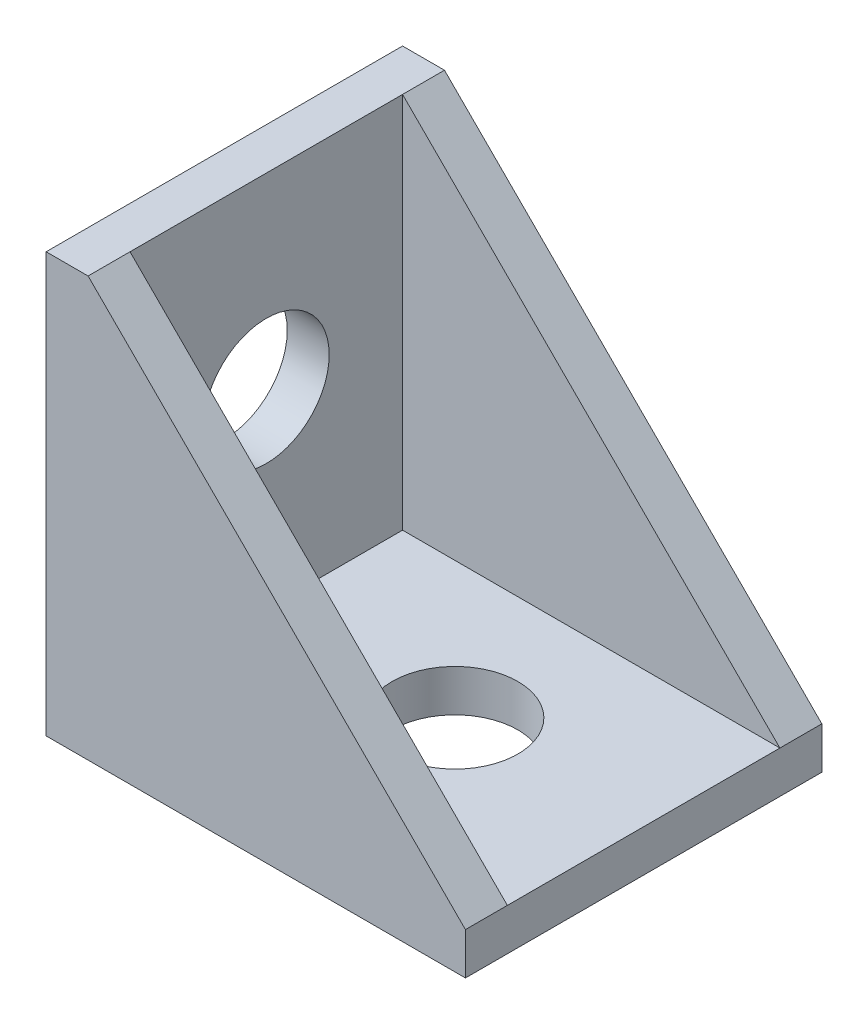
ISO-10303-21;
HEADER;
FILE_DESCRIPTION(('STEP AP214'),'2;1');
FILE_NAME('part.step','',(''),(''),'','','');
FILE_SCHEMA(('AUTOMOTIVE_DESIGN { 1 0 10303 214 1 1 1 1 }'));
ENDSEC;
DATA;
#1=APPLICATION_CONTEXT('core data for automotive mechanical design processes');
#2=APPLICATION_PROTOCOL_DEFINITION('international standard','automotive_design',2000,#1);
#3=PRODUCT_CONTEXT('',#1,'mechanical');
#4=PRODUCT('Part','Part','',(#3));
#5=PRODUCT_RELATED_PRODUCT_CATEGORY('part','',(#4));
#6=PRODUCT_DEFINITION_FORMATION('','',#4);
#7=PRODUCT_DEFINITION_CONTEXT('part definition',#1,'design');
#8=PRODUCT_DEFINITION('design','',#6,#7);
#9=PRODUCT_DEFINITION_SHAPE('','',#8);
#10=(LENGTH_UNIT() NAMED_UNIT(*) SI_UNIT(.MILLI.,.METRE.));
#11=(NAMED_UNIT(*) PLANE_ANGLE_UNIT() SI_UNIT($,.RADIAN.));
#12=(NAMED_UNIT(*) SI_UNIT($,.STERADIAN.) SOLID_ANGLE_UNIT());
#13=UNCERTAINTY_MEASURE_WITH_UNIT(LENGTH_MEASURE(1.E-05),#10,'distance_accuracy_value','');
#14=(GEOMETRIC_REPRESENTATION_CONTEXT(3) GLOBAL_UNCERTAINTY_ASSIGNED_CONTEXT((#13)) GLOBAL_UNIT_ASSIGNED_CONTEXT((#10,
#11,#12)) REPRESENTATION_CONTEXT('',''));
#15=CARTESIAN_POINT('',(0.,0.,0.));
#16=DIRECTION('',(0.,0.,1.));
#17=DIRECTION('',(1.,0.,0.));
#18=AXIS2_PLACEMENT_3D('',#15,#16,#17);
#19=CARTESIAN_POINT('',(2.,20.,17.));
#20=DIRECTION('',(-0.707106781186548,-0.707106781186548,0.));
#21=DIRECTION('',(0.707106781186548,-0.707106781186548,0.));
#22=AXIS2_PLACEMENT_3D('',#19,#20,#21);
#23=PLANE('',#22);
#24=DIRECTION('',(0.,0.,-1.));
#25=VECTOR('',#24,1.);
#26=CARTESIAN_POINT('',(2.,20.,17.));
#27=LINE('',#26,#25);
#28=CARTESIAN_POINT('',(2.,20.,2.));
#29=VERTEX_POINT('',#28);
#30=CARTESIAN_POINT('',(2.,20.,0.));
#31=VERTEX_POINT('',#30);
#32=EDGE_CURVE('E116',#29,#31,#27,.T.);
#33=ORIENTED_EDGE('',*,*,#32,.F.);
#34=DIRECTION('',(0.707106781186548,-0.707106781186548,0.));
#35=VECTOR('',#34,1.);
#36=CARTESIAN_POINT('',(2.,20.,2.));
#37=LINE('',#36,#35);
#38=CARTESIAN_POINT('',(20.,2.,2.));
#39=VERTEX_POINT('',#38);
#40=EDGE_CURVE('E12',#29,#39,#37,.T.);
#41=ORIENTED_EDGE('',*,*,#40,.T.);
#42=DIRECTION('',(0.,0.,-1.));
#43=VECTOR('',#42,1.);
#44=CARTESIAN_POINT('',(20.,2.,17.));
#45=LINE('',#44,#43);
#46=CARTESIAN_POINT('',(20.,2.,0.));
#47=VERTEX_POINT('',#46);
#48=EDGE_CURVE('E115',#39,#47,#45,.T.);
#49=ORIENTED_EDGE('',*,*,#48,.T.);
#50=DIRECTION('',(-0.707106781186547,0.707106781186547,0.));
#51=VECTOR('',#50,1.);
#52=CARTESIAN_POINT('',(2.,20.,0.));
#53=LINE('',#52,#51);
#54=EDGE_CURVE('E132',#47,#31,#53,.T.);
#55=ORIENTED_EDGE('',*,*,#54,.T.);
#56=EDGE_LOOP('',(#33,#41,#49,#55));
#57=FACE_BOUND('',#56,.T.);
#58=ADVANCED_FACE('F34',(#57),#23,.F.);
#59=CARTESIAN_POINT('',(20.,0.,17.));
#60=DIRECTION('',(0.,1.,0.));
#61=DIRECTION('',(-1.,0.,0.));
#62=AXIS2_PLACEMENT_3D('',#59,#60,#61);
#63=PLANE('',#62);
#64=CARTESIAN_POINT('',(11.,0.,8.5));
#65=DIRECTION('',(0.,1.,0.));
#66=DIRECTION('',(-1.,0.,0.));
#67=AXIS2_PLACEMENT_3D('',#64,#65,#66);
#68=CIRCLE('',#67,3.);
#69=CARTESIAN_POINT('',(8.,0.,8.5));
#70=VERTEX_POINT('',#69);
#71=EDGE_CURVE('E193',#70,#70,#68,.T.);
#72=ORIENTED_EDGE('',*,*,#71,.T.);
#73=EDGE_LOOP('',(#72));
#74=FACE_BOUND('',#73,.T.);
#75=DIRECTION('',(1.,0.,0.));
#76=VECTOR('',#75,1.);
#77=CARTESIAN_POINT('',(20.,0.,0.));
#78=LINE('',#77,#76);
#79=CARTESIAN_POINT('',(0.,0.,0.));
#80=VERTEX_POINT('',#79);
#81=CARTESIAN_POINT('',(20.,0.,0.));
#82=VERTEX_POINT('',#81);
#83=EDGE_CURVE('E125',#80,#82,#78,.T.);
#84=ORIENTED_EDGE('',*,*,#83,.T.);
#85=DIRECTION('',(0.,0.,-1.));
#86=VECTOR('',#85,1.);
#87=CARTESIAN_POINT('',(20.,0.,17.));
#88=LINE('',#87,#86);
#89=CARTESIAN_POINT('',(20.,0.,17.));
#90=VERTEX_POINT('',#89);
#91=EDGE_CURVE('E143',#90,#82,#88,.T.);
#92=ORIENTED_EDGE('',*,*,#91,.F.);
#93=DIRECTION('',(1.,0.,0.));
#94=VECTOR('',#93,1.);
#95=CARTESIAN_POINT('',(20.,0.,17.));
#96=LINE('',#95,#94);
#97=CARTESIAN_POINT('',(0.,0.,17.));
#98=VERTEX_POINT('',#97);
#99=EDGE_CURVE('E138',#98,#90,#96,.T.);
#100=ORIENTED_EDGE('',*,*,#99,.F.);
#101=DIRECTION('',(0.,0.,-1.));
#102=VECTOR('',#101,1.);
#103=CARTESIAN_POINT('',(0.,0.,17.));
#104=LINE('',#103,#102);
#105=EDGE_CURVE('E121',#98,#80,#104,.T.);
#106=ORIENTED_EDGE('',*,*,#105,.T.);
#107=EDGE_LOOP('',(#84,#92,#100,#106));
#108=FACE_BOUND('',#107,.T.);
#109=ADVANCED_FACE('F36',(#74,#108),#63,.F.);
#110=CARTESIAN_POINT('',(20.,2.,17.));
#111=DIRECTION('',(-1.,0.,0.));
#112=DIRECTION('',(0.,0.,1.));
#113=AXIS2_PLACEMENT_3D('',#110,#111,#112);
#114=PLANE('',#113);
#115=DIRECTION('',(0.,1.,0.));
#116=VECTOR('',#115,1.);
#117=CARTESIAN_POINT('',(20.,2.,0.));
#118=LINE('',#117,#116);
#119=EDGE_CURVE('E128',#82,#47,#118,.T.);
#120=ORIENTED_EDGE('',*,*,#119,.T.);
#121=ORIENTED_EDGE('',*,*,#48,.F.);
#122=DIRECTION('',(0.,0.,1.));
#123=VECTOR('',#122,1.);
#124=CARTESIAN_POINT('',(20.,2.,2.));
#125=LINE('',#124,#123);
#126=CARTESIAN_POINT('',(20.,1.99999999999999,15.));
#127=VERTEX_POINT('',#126);
#128=EDGE_CURVE('E159',#39,#127,#125,.T.);
#129=ORIENTED_EDGE('',*,*,#128,.T.);
#130=CARTESIAN_POINT('',(20.,2.,17.));
#131=VERTEX_POINT('',#130);
#132=EDGE_CURVE('E141',#131,#127,#45,.T.);
#133=ORIENTED_EDGE('',*,*,#132,.F.);
#134=DIRECTION('',(0.,1.,0.));
#135=VECTOR('',#134,1.);
#136=CARTESIAN_POINT('',(20.,2.,17.));
#137=LINE('',#136,#135);
#138=EDGE_CURVE('E91',#90,#131,#137,.T.);
#139=ORIENTED_EDGE('',*,*,#138,.F.);
#140=ORIENTED_EDGE('',*,*,#91,.T.);
#141=EDGE_LOOP('',(#120,#121,#129,#133,#139,#140));
#142=FACE_BOUND('',#141,.T.);
#143=ADVANCED_FACE('F145',(#142),#114,.F.);
#144=ORIENTED_EDGE('',*,*,#132,.T.);
#145=DIRECTION('',(-0.707106781186548,0.707106781186548,0.));
#146=VECTOR('',#145,1.);
#147=CARTESIAN_POINT('',(2.,20.,15.));
#148=LINE('',#147,#146);
#149=CARTESIAN_POINT('',(2.,20.,15.));
#150=VERTEX_POINT('',#149);
#151=EDGE_CURVE('E42',#127,#150,#148,.T.);
#152=ORIENTED_EDGE('',*,*,#151,.T.);
#153=CARTESIAN_POINT('',(2.,20.,17.));
#154=VERTEX_POINT('',#153);
#155=EDGE_CURVE('E109',#154,#150,#27,.T.);
#156=ORIENTED_EDGE('',*,*,#155,.F.);
#157=DIRECTION('',(-0.707106781186547,0.707106781186547,0.));
#158=VECTOR('',#157,1.);
#159=CARTESIAN_POINT('',(2.,20.,17.));
#160=LINE('',#159,#158);
#161=EDGE_CURVE('E98',#131,#154,#160,.T.);
#162=ORIENTED_EDGE('',*,*,#161,.F.);
#163=EDGE_LOOP('',(#144,#152,#156,#162));
#164=FACE_BOUND('',#163,.T.);
#165=ADVANCED_FACE('F110',(#164),#23,.F.);
#166=CARTESIAN_POINT('',(0.,20.,17.));
#167=DIRECTION('',(0.,-1.,0.));
#168=DIRECTION('',(0.,0.,-1.));
#169=AXIS2_PLACEMENT_3D('',#166,#167,#168);
#170=PLANE('',#169);
#171=DIRECTION('',(-1.,0.,0.));
#172=VECTOR('',#171,1.);
#173=CARTESIAN_POINT('',(0.,20.,0.));
#174=LINE('',#173,#172);
#175=CARTESIAN_POINT('',(0.,20.,0.));
#176=VERTEX_POINT('',#175);
#177=EDGE_CURVE('E135',#31,#176,#174,.T.);
#178=ORIENTED_EDGE('',*,*,#177,.T.);
#179=DIRECTION('',(0.,0.,-1.));
#180=VECTOR('',#179,1.);
#181=CARTESIAN_POINT('',(0.,20.,17.));
#182=LINE('',#181,#180);
#183=CARTESIAN_POINT('',(0.,20.,17.));
#184=VERTEX_POINT('',#183);
#185=EDGE_CURVE('E119',#184,#176,#182,.T.);
#186=ORIENTED_EDGE('',*,*,#185,.F.);
#187=DIRECTION('',(-1.,0.,0.));
#188=VECTOR('',#187,1.);
#189=CARTESIAN_POINT('',(0.,20.,17.));
#190=LINE('',#189,#188);
#191=EDGE_CURVE('E102',#154,#184,#190,.T.);
#192=ORIENTED_EDGE('',*,*,#191,.F.);
#193=ORIENTED_EDGE('',*,*,#155,.T.);
#194=DIRECTION('',(0.,0.,1.));
#195=VECTOR('',#194,1.);
#196=CARTESIAN_POINT('',(2.,20.,2.));
#197=LINE('',#196,#195);
#198=EDGE_CURVE('E176',#29,#150,#197,.T.);
#199=ORIENTED_EDGE('',*,*,#198,.F.);
#200=ORIENTED_EDGE('',*,*,#32,.T.);
#201=EDGE_LOOP('',(#178,#186,#192,#193,#199,#200));
#202=FACE_BOUND('',#201,.T.);
#203=ADVANCED_FACE('F118',(#202),#170,.F.);
#204=CARTESIAN_POINT('',(0.,0.,17.));
#205=DIRECTION('',(1.,0.,0.));
#206=DIRECTION('',(0.,0.,-1.));
#207=AXIS2_PLACEMENT_3D('',#204,#205,#206);
#208=PLANE('',#207);
#209=CARTESIAN_POINT('',(0.,11.,8.5));
#210=DIRECTION('',(1.,0.,0.));
#211=DIRECTION('',(0.,0.,-1.));
#212=AXIS2_PLACEMENT_3D('',#209,#210,#211);
#213=CIRCLE('',#212,3.);
#214=CARTESIAN_POINT('',(0.,11.,5.5));
#215=VERTEX_POINT('',#214);
#216=EDGE_CURVE('E179',#215,#215,#213,.T.);
#217=ORIENTED_EDGE('',*,*,#216,.T.);
#218=EDGE_LOOP('',(#217));
#219=FACE_BOUND('',#218,.T.);
#220=DIRECTION('',(0.,-1.,0.));
#221=VECTOR('',#220,1.);
#222=CARTESIAN_POINT('',(0.,0.,0.));
#223=LINE('',#222,#221);
#224=EDGE_CURVE('E82',#176,#80,#223,.T.);
#225=ORIENTED_EDGE('',*,*,#224,.T.);
#226=ORIENTED_EDGE('',*,*,#105,.F.);
#227=DIRECTION('',(0.,-1.,0.));
#228=VECTOR('',#227,1.);
#229=CARTESIAN_POINT('',(0.,0.,17.));
#230=LINE('',#229,#228);
#231=EDGE_CURVE('E58',#184,#98,#230,.T.);
#232=ORIENTED_EDGE('',*,*,#231,.F.);
#233=ORIENTED_EDGE('',*,*,#185,.T.);
#234=EDGE_LOOP('',(#225,#226,#232,#233));
#235=FACE_BOUND('',#234,.T.);
#236=ADVANCED_FACE('F233',(#219,#235),#208,.F.);
#237=CARTESIAN_POINT('',(0.,0.,17.));
#238=DIRECTION('',(0.,0.,-1.));
#239=DIRECTION('',(-1.,0.,0.));
#240=AXIS2_PLACEMENT_3D('',#237,#238,#239);
#241=PLANE('',#240);
#242=ORIENTED_EDGE('',*,*,#99,.T.);
#243=ORIENTED_EDGE('',*,*,#138,.T.);
#244=ORIENTED_EDGE('',*,*,#161,.T.);
#245=ORIENTED_EDGE('',*,*,#191,.T.);
#246=ORIENTED_EDGE('',*,*,#231,.T.);
#247=EDGE_LOOP('',(#242,#243,#244,#245,#246));
#248=FACE_BOUND('',#247,.T.);
#249=ADVANCED_FACE('F100',(#248),#241,.F.);
#250=CARTESIAN_POINT('',(0.,0.,0.));
#251=DIRECTION('',(0.,0.,-1.));
#252=DIRECTION('',(-1.,0.,0.));
#253=AXIS2_PLACEMENT_3D('',#250,#251,#252);
#254=PLANE('',#253);
#255=ORIENTED_EDGE('',*,*,#83,.F.);
#256=ORIENTED_EDGE('',*,*,#224,.F.);
#257=ORIENTED_EDGE('',*,*,#177,.F.);
#258=ORIENTED_EDGE('',*,*,#54,.F.);
#259=ORIENTED_EDGE('',*,*,#119,.F.);
#260=EDGE_LOOP('',(#255,#256,#257,#258,#259));
#261=FACE_BOUND('',#260,.T.);
#262=ADVANCED_FACE('F152',(#261),#254,.T.);
#263=CARTESIAN_POINT('',(2.,-22.2036033111745,2.));
#264=DIRECTION('',(0.,0.,-1.));
#265=DIRECTION('',(-1.,0.,0.));
#266=AXIS2_PLACEMENT_3D('',#263,#264,#265);
#267=PLANE('',#266);
#268=DIRECTION('',(0.,1.,0.));
#269=VECTOR('',#268,1.);
#270=CARTESIAN_POINT('',(2.,-22.2036033111745,2.));
#271=LINE('',#270,#269);
#272=CARTESIAN_POINT('',(2.,2.,2.));
#273=VERTEX_POINT('',#272);
#274=EDGE_CURVE('E49',#273,#29,#271,.T.);
#275=ORIENTED_EDGE('',*,*,#274,.F.);
#276=DIRECTION('',(1.,0.,0.));
#277=VECTOR('',#276,1.);
#278=CARTESIAN_POINT('',(2.,2.,2.));
#279=LINE('',#278,#277);
#280=EDGE_CURVE('E163',#273,#39,#279,.T.);
#281=ORIENTED_EDGE('',*,*,#280,.T.);
#282=ORIENTED_EDGE('',*,*,#40,.F.);
#283=EDGE_LOOP('',(#275,#281,#282));
#284=FACE_BOUND('',#283,.T.);
#285=ADVANCED_FACE('F213',(#284),#267,.F.);
#286=CARTESIAN_POINT('',(2.,-22.2036033111745,15.));
#287=DIRECTION('',(0.,0.,1.));
#288=DIRECTION('',(1.,0.,0.));
#289=AXIS2_PLACEMENT_3D('',#286,#287,#288);
#290=PLANE('',#289);
#291=DIRECTION('',(-1.,0.,0.));
#292=VECTOR('',#291,1.);
#293=CARTESIAN_POINT('',(2.,2.,15.));
#294=LINE('',#293,#292);
#295=CARTESIAN_POINT('',(2.,2.,15.));
#296=VERTEX_POINT('',#295);
#297=EDGE_CURVE('E129',#127,#296,#294,.T.);
#298=ORIENTED_EDGE('',*,*,#297,.T.);
#299=DIRECTION('',(0.,1.,0.));
#300=VECTOR('',#299,1.);
#301=CARTESIAN_POINT('',(2.,-22.2036033111745,15.));
#302=LINE('',#301,#300);
#303=EDGE_CURVE('E172',#296,#150,#302,.T.);
#304=ORIENTED_EDGE('',*,*,#303,.T.);
#305=ORIENTED_EDGE('',*,*,#151,.F.);
#306=EDGE_LOOP('',(#298,#304,#305));
#307=FACE_BOUND('',#306,.T.);
#308=ADVANCED_FACE('F173',(#307),#290,.F.);
#309=CARTESIAN_POINT('',(2.,-22.2036033111745,2.));
#310=DIRECTION('',(-1.,0.,0.));
#311=DIRECTION('',(0.,0.,1.));
#312=AXIS2_PLACEMENT_3D('',#309,#310,#311);
#313=PLANE('',#312);
#314=CARTESIAN_POINT('',(2.,11.,8.5));
#315=DIRECTION('',(1.,0.,0.));
#316=DIRECTION('',(0.,0.,-1.));
#317=AXIS2_PLACEMENT_3D('',#314,#315,#316);
#318=CIRCLE('',#317,3.);
#319=CARTESIAN_POINT('',(2.,11.,5.5));
#320=VERTEX_POINT('',#319);
#321=EDGE_CURVE('E182',#320,#320,#318,.T.);
#322=ORIENTED_EDGE('',*,*,#321,.F.);
#323=EDGE_LOOP('',(#322));
#324=FACE_BOUND('',#323,.T.);
#325=DIRECTION('',(0.,0.,-1.));
#326=VECTOR('',#325,1.);
#327=CARTESIAN_POINT('',(2.,2.,2.));
#328=LINE('',#327,#326);
#329=EDGE_CURVE('E186',#296,#273,#328,.T.);
#330=ORIENTED_EDGE('',*,*,#329,.T.);
#331=ORIENTED_EDGE('',*,*,#274,.T.);
#332=ORIENTED_EDGE('',*,*,#198,.T.);
#333=ORIENTED_EDGE('',*,*,#303,.F.);
#334=EDGE_LOOP('',(#330,#331,#332,#333));
#335=FACE_BOUND('',#334,.T.);
#336=ADVANCED_FACE('F178',(#324,#335),#313,.F.);
#337=CARTESIAN_POINT('',(20.,2.,17.));
#338=DIRECTION('',(0.,1.,0.));
#339=DIRECTION('',(-1.,0.,0.));
#340=AXIS2_PLACEMENT_3D('',#337,#338,#339);
#341=PLANE('',#340);
#342=CARTESIAN_POINT('',(11.,2.,8.5));
#343=DIRECTION('',(0.,1.,0.));
#344=DIRECTION('',(-1.,0.,0.));
#345=AXIS2_PLACEMENT_3D('',#342,#343,#344);
#346=CIRCLE('',#345,3.);
#347=CARTESIAN_POINT('',(8.,2.,8.5));
#348=VERTEX_POINT('',#347);
#349=EDGE_CURVE('E195',#348,#348,#346,.T.);
#350=ORIENTED_EDGE('',*,*,#349,.F.);
#351=EDGE_LOOP('',(#350));
#352=FACE_BOUND('',#351,.T.);
#353=ORIENTED_EDGE('',*,*,#329,.F.);
#354=ORIENTED_EDGE('',*,*,#297,.F.);
#355=ORIENTED_EDGE('',*,*,#128,.F.);
#356=ORIENTED_EDGE('',*,*,#280,.F.);
#357=EDGE_LOOP('',(#353,#354,#355,#356));
#358=FACE_BOUND('',#357,.T.);
#359=ADVANCED_FACE('F209',(#352,#358),#341,.T.);
#360=CARTESIAN_POINT('',(0.,11.,8.5));
#361=DIRECTION('',(1.,0.,0.));
#362=DIRECTION('',(0.,0.,-1.));
#363=AXIS2_PLACEMENT_3D('',#360,#361,#362);
#364=CYLINDRICAL_SURFACE('',#363,3.);
#365=ORIENTED_EDGE('',*,*,#216,.F.);
#366=EDGE_LOOP('',(#365));
#367=FACE_BOUND('',#366,.T.);
#368=ORIENTED_EDGE('',*,*,#321,.T.);
#369=EDGE_LOOP('',(#368));
#370=FACE_BOUND('',#369,.T.);
#371=ADVANCED_FACE('F205',(#367,#370),#364,.F.);
#372=CARTESIAN_POINT('',(11.,0.,8.5));
#373=DIRECTION('',(0.,1.,0.));
#374=DIRECTION('',(-1.,0.,0.));
#375=AXIS2_PLACEMENT_3D('',#372,#373,#374);
#376=CYLINDRICAL_SURFACE('',#375,3.);
#377=ORIENTED_EDGE('',*,*,#71,.F.);
#378=EDGE_LOOP('',(#377));
#379=FACE_BOUND('',#378,.T.);
#380=ORIENTED_EDGE('',*,*,#349,.T.);
#381=EDGE_LOOP('',(#380));
#382=FACE_BOUND('',#381,.T.);
#383=ADVANCED_FACE('F202',(#379,#382),#376,.F.);
#384=CLOSED_SHELL('',(#58,#109,#143,#165,#203,#236,#249,#262,#285,#308,#336,#359,#371,#383));
#385=MANIFOLD_SOLID_BREP('B2',#384);
#386=ADVANCED_BREP_SHAPE_REPRESENTATION('',(#18,#385),#14);
#387=SHAPE_DEFINITION_REPRESENTATION(#9,#386);
ENDSEC;
END-ISO-10303-21;
